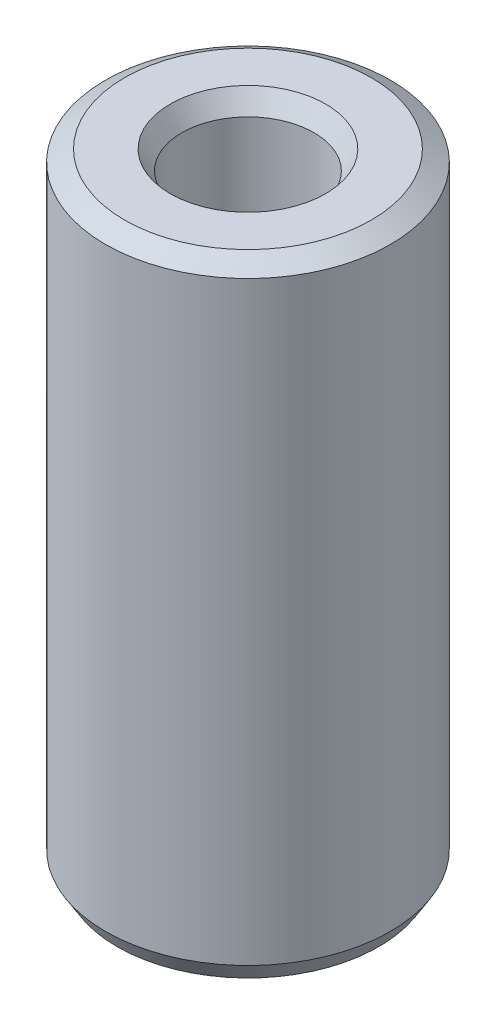
ISO-10303-21;
HEADER;
FILE_DESCRIPTION(('STEP AP214'),'2;1');
FILE_NAME('part.step','',(''),(''),'','','');
FILE_SCHEMA(('AUTOMOTIVE_DESIGN { 1 0 10303 214 1 1 1 1 }'));
ENDSEC;
DATA;
#1=APPLICATION_CONTEXT('core data for automotive mechanical design processes');
#2=APPLICATION_PROTOCOL_DEFINITION('international standard','automotive_design',2000,#1);
#3=PRODUCT_CONTEXT('',#1,'mechanical');
#4=PRODUCT('Part','Part','',(#3));
#5=PRODUCT_RELATED_PRODUCT_CATEGORY('part','',(#4));
#6=PRODUCT_DEFINITION_FORMATION('','',#4);
#7=PRODUCT_DEFINITION_CONTEXT('part definition',#1,'design');
#8=PRODUCT_DEFINITION('design','',#6,#7);
#9=PRODUCT_DEFINITION_SHAPE('','',#8);
#10=(LENGTH_UNIT() NAMED_UNIT(*) SI_UNIT(.MILLI.,.METRE.));
#11=(NAMED_UNIT(*) PLANE_ANGLE_UNIT() SI_UNIT($,.RADIAN.));
#12=(NAMED_UNIT(*) SI_UNIT($,.STERADIAN.) SOLID_ANGLE_UNIT());
#13=UNCERTAINTY_MEASURE_WITH_UNIT(LENGTH_MEASURE(1.E-05),#10,'distance_accuracy_value','');
#14=(GEOMETRIC_REPRESENTATION_CONTEXT(3) GLOBAL_UNCERTAINTY_ASSIGNED_CONTEXT((#13)) GLOBAL_UNIT_ASSIGNED_CONTEXT((#10,
#11,#12)) REPRESENTATION_CONTEXT('',''));
#15=CARTESIAN_POINT('',(0.,0.,0.));
#16=DIRECTION('',(0.,0.,1.));
#17=DIRECTION('',(1.,0.,0.));
#18=AXIS2_PLACEMENT_3D('',#15,#16,#17);
#19=CARTESIAN_POINT('',(0.,208.67276304076,0.));
#20=DIRECTION('',(0.,-1.,0.));
#21=DIRECTION('',(0.,0.,-1.));
#22=AXIS2_PLACEMENT_3D('',#19,#20,#21);
#23=CYLINDRICAL_SURFACE('',#22,47.5);
#24=CARTESIAN_POINT('',(0.,6.34764902589052,0.));
#25=DIRECTION('',(0.,1.,0.));
#26=DIRECTION('',(0.,0.,1.));
#27=AXIS2_PLACEMENT_3D('',#24,#25,#26);
#28=CIRCLE('',#27,47.5);
#29=CARTESIAN_POINT('',(0.,6.34764902589052,47.5));
#30=VERTEX_POINT('',#29);
#31=EDGE_CURVE('E10',#30,#30,#28,.T.);
#32=ORIENTED_EDGE('',*,*,#31,.T.);
#33=EDGE_LOOP('',(#32));
#34=FACE_BOUND('',#33,.T.);
#35=CARTESIAN_POINT('',(0.,204.802816126164,0.));
#36=DIRECTION('',(0.,1.,0.));
#37=DIRECTION('',(0.,0.,1.));
#38=AXIS2_PLACEMENT_3D('',#35,#36,#37);
#39=CIRCLE('',#38,47.5);
#40=CARTESIAN_POINT('',(0.,204.802816126164,47.5));
#41=VERTEX_POINT('',#40);
#42=EDGE_CURVE('E50',#41,#41,#39,.F.);
#43=ORIENTED_EDGE('',*,*,#42,.T.);
#44=EDGE_LOOP('',(#43));
#45=FACE_BOUND('',#44,.T.);
#46=ADVANCED_FACE('F39',(#34,#45),#23,.T.);
#47=CARTESIAN_POINT('',(0.,208.67276304076,0.));
#48=DIRECTION('',(0.,1.,0.));
#49=DIRECTION('',(0.,0.,1.));
#50=AXIS2_PLACEMENT_3D('',#47,#48,#49);
#51=PLANE('',#50);
#52=CARTESIAN_POINT('',(0.,208.67276304076,0.));
#53=DIRECTION('',(0.,1.,0.));
#54=DIRECTION('',(0.,0.,1.));
#55=AXIS2_PLACEMENT_3D('',#52,#53,#54);
#56=CIRCLE('',#55,25.9217562679948);
#57=CARTESIAN_POINT('',(0.,208.67276304076,25.9217562679948));
#58=VERTEX_POINT('',#57);
#59=EDGE_CURVE('E58',#58,#58,#56,.F.);
#60=ORIENTED_EDGE('',*,*,#59,.T.);
#61=EDGE_LOOP('',(#60));
#62=FACE_BOUND('',#61,.T.);
#63=CARTESIAN_POINT('',(0.,208.67276304076,0.));
#64=DIRECTION('',(0.,1.,0.));
#65=DIRECTION('',(0.,0.,1.));
#66=AXIS2_PLACEMENT_3D('',#63,#64,#65);
#67=CIRCLE('',#66,41.1523509741095);
#68=CARTESIAN_POINT('',(0.,208.67276304076,41.1523509741095));
#69=VERTEX_POINT('',#68);
#70=EDGE_CURVE('E61',#69,#69,#67,.T.);
#71=ORIENTED_EDGE('',*,*,#70,.T.);
#72=EDGE_LOOP('',(#71));
#73=FACE_BOUND('',#72,.T.);
#74=ADVANCED_FACE('F88',(#62,#73),#51,.T.);
#75=CARTESIAN_POINT('',(0.,0.,0.));
#76=DIRECTION('',(0.,1.,0.));
#77=DIRECTION('',(0.,0.,1.));
#78=AXIS2_PLACEMENT_3D('',#75,#76,#77);
#79=PLANE('',#78);
#80=CARTESIAN_POINT('',(0.,0.,0.));
#81=DIRECTION('',(0.,1.,0.));
#82=DIRECTION('',(0.,0.,1.));
#83=AXIS2_PLACEMENT_3D('',#80,#81,#82);
#84=CIRCLE('',#83,28.3994583792901);
#85=CARTESIAN_POINT('',(0.,0.,28.3994583792901));
#86=VERTEX_POINT('',#85);
#87=EDGE_CURVE('E51',#86,#86,#84,.T.);
#88=ORIENTED_EDGE('',*,*,#87,.T.);
#89=EDGE_LOOP('',(#88));
#90=FACE_BOUND('',#89,.T.);
#91=CARTESIAN_POINT('',(0.,0.,0.));
#92=DIRECTION('',(0.,1.,0.));
#93=DIRECTION('',(0.,0.,1.));
#94=AXIS2_PLACEMENT_3D('',#91,#92,#93);
#95=CIRCLE('',#94,43.6300530854049);
#96=CARTESIAN_POINT('',(0.,0.,43.6300530854049));
#97=VERTEX_POINT('',#96);
#98=EDGE_CURVE('E54',#97,#97,#95,.F.);
#99=ORIENTED_EDGE('',*,*,#98,.T.);
#100=EDGE_LOOP('',(#99));
#101=FACE_BOUND('',#100,.T.);
#102=ADVANCED_FACE('F83',(#90,#101),#79,.F.);
#103=CARTESIAN_POINT('',(0.,208.67276304076,0.));
#104=DIRECTION('',(0.,-1.,0.));
#105=DIRECTION('',(0.,0.,-1.));
#106=AXIS2_PLACEMENT_3D('',#103,#104,#105);
#107=CYLINDRICAL_SURFACE('',#106,22.0518093533997);
#108=CARTESIAN_POINT('',(0.,202.325114014869,0.));
#109=DIRECTION('',(0.,1.,0.));
#110=DIRECTION('',(0.,0.,1.));
#111=AXIS2_PLACEMENT_3D('',#108,#109,#110);
#112=CIRCLE('',#111,22.0518093533997);
#113=CARTESIAN_POINT('',(0.,202.325114014869,22.0518093533997));
#114=VERTEX_POINT('',#113);
#115=EDGE_CURVE('E67',#114,#114,#112,.T.);
#116=ORIENTED_EDGE('',*,*,#115,.T.);
#117=EDGE_LOOP('',(#116));
#118=FACE_BOUND('',#117,.T.);
#119=CARTESIAN_POINT('',(0.,3.86994691459508,0.));
#120=DIRECTION('',(0.,1.,0.));
#121=DIRECTION('',(0.,0.,1.));
#122=AXIS2_PLACEMENT_3D('',#119,#120,#121);
#123=CIRCLE('',#122,22.0518093533997);
#124=CARTESIAN_POINT('',(0.,3.86994691459508,22.0518093533997));
#125=VERTEX_POINT('',#124);
#126=EDGE_CURVE('E69',#125,#125,#123,.F.);
#127=ORIENTED_EDGE('',*,*,#126,.T.);
#128=EDGE_LOOP('',(#127));
#129=FACE_BOUND('',#128,.T.);
#130=ADVANCED_FACE('F71',(#118,#129),#107,.F.);
#131=CARTESIAN_POINT('',(0.,202.325114014869,0.));
#132=DIRECTION('',(0.,1.,0.));
#133=DIRECTION('',(0.,0.,1.));
#134=AXIS2_PLACEMENT_3D('',#131,#132,#133);
#135=CONICAL_SURFACE('',#134,22.0518093533997,0.547496684121568);
#136=ORIENTED_EDGE('',*,*,#59,.F.);
#137=EDGE_LOOP('',(#136));
#138=FACE_BOUND('',#137,.T.);
#139=ORIENTED_EDGE('',*,*,#115,.F.);
#140=EDGE_LOOP('',(#139));
#141=FACE_BOUND('',#140,.T.);
#142=ADVANCED_FACE('F77',(#138,#141),#135,.F.);
#143=CARTESIAN_POINT('',(0.,0.,0.));
#144=DIRECTION('',(0.,-1.,0.));
#145=DIRECTION('',(0.,0.,-1.));
#146=AXIS2_PLACEMENT_3D('',#143,#144,#145);
#147=CONICAL_SURFACE('',#146,28.3994583792901,1.02329964267333);
#148=ORIENTED_EDGE('',*,*,#126,.F.);
#149=EDGE_LOOP('',(#148));
#150=FACE_BOUND('',#149,.T.);
#151=ORIENTED_EDGE('',*,*,#87,.F.);
#152=EDGE_LOOP('',(#151));
#153=FACE_BOUND('',#152,.T.);
#154=ADVANCED_FACE('F73',(#150,#153),#147,.F.);
#155=CARTESIAN_POINT('',(0.,6.34764902589052,0.));
#156=DIRECTION('',(0.,1.,0.));
#157=DIRECTION('',(0.,0.,1.));
#158=AXIS2_PLACEMENT_3D('',#155,#156,#157);
#159=CONICAL_SURFACE('',#158,47.5,0.547496684121571);
#160=ORIENTED_EDGE('',*,*,#98,.F.);
#161=EDGE_LOOP('',(#160));
#162=FACE_BOUND('',#161,.T.);
#163=ORIENTED_EDGE('',*,*,#31,.F.);
#164=EDGE_LOOP('',(#163));
#165=FACE_BOUND('',#164,.T.);
#166=ADVANCED_FACE('F76',(#162,#165),#159,.T.);
#167=CARTESIAN_POINT('',(0.,208.67276304076,0.));
#168=DIRECTION('',(0.,-1.,0.));
#169=DIRECTION('',(0.,0.,-1.));
#170=AXIS2_PLACEMENT_3D('',#167,#168,#169);
#171=CONICAL_SURFACE('',#170,41.1523509741095,1.02329964267333);
#172=ORIENTED_EDGE('',*,*,#42,.F.);
#173=EDGE_LOOP('',(#172));
#174=FACE_BOUND('',#173,.T.);
#175=ORIENTED_EDGE('',*,*,#70,.F.);
#176=EDGE_LOOP('',(#175));
#177=FACE_BOUND('',#176,.T.);
#178=ADVANCED_FACE('F45',(#174,#177),#171,.T.);
#179=CLOSED_SHELL('',(#46,#74,#102,#130,#142,#154,#166,#178));
#180=MANIFOLD_SOLID_BREP('B2',#179);
#181=ADVANCED_BREP_SHAPE_REPRESENTATION('',(#18,#180),#14);
#182=SHAPE_DEFINITION_REPRESENTATION(#9,#181);
ENDSEC;
END-ISO-10303-21;
